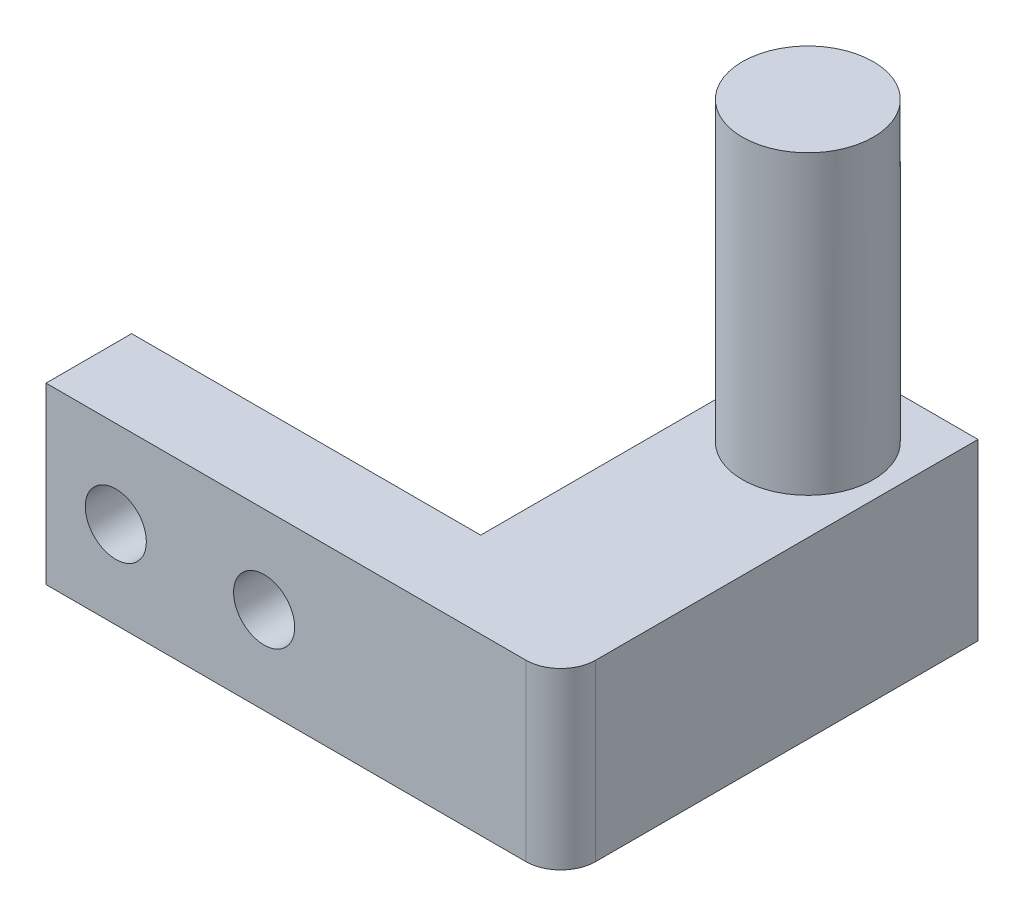
ISO-10303-21;
HEADER;
FILE_DESCRIPTION(('STEP AP214'),'2;1');
FILE_NAME('part.step','',(''),(''),'','','');
FILE_SCHEMA(('AUTOMOTIVE_DESIGN { 1 0 10303 214 1 1 1 1 }'));
ENDSEC;
DATA;
#1=APPLICATION_CONTEXT('core data for automotive mechanical design processes');
#2=APPLICATION_PROTOCOL_DEFINITION('international standard','automotive_design',2000,#1);
#3=PRODUCT_CONTEXT('',#1,'mechanical');
#4=PRODUCT('Part','Part','',(#3));
#5=PRODUCT_RELATED_PRODUCT_CATEGORY('part','',(#4));
#6=PRODUCT_DEFINITION_FORMATION('','',#4);
#7=PRODUCT_DEFINITION_CONTEXT('part definition',#1,'design');
#8=PRODUCT_DEFINITION('design','',#6,#7);
#9=PRODUCT_DEFINITION_SHAPE('','',#8);
#10=(LENGTH_UNIT() NAMED_UNIT(*) SI_UNIT(.MILLI.,.METRE.));
#11=(NAMED_UNIT(*) PLANE_ANGLE_UNIT() SI_UNIT($,.RADIAN.));
#12=(NAMED_UNIT(*) SI_UNIT($,.STERADIAN.) SOLID_ANGLE_UNIT());
#13=UNCERTAINTY_MEASURE_WITH_UNIT(LENGTH_MEASURE(1.E-05),#10,'distance_accuracy_value','');
#14=(GEOMETRIC_REPRESENTATION_CONTEXT(3) GLOBAL_UNCERTAINTY_ASSIGNED_CONTEXT((#13)) GLOBAL_UNIT_ASSIGNED_CONTEXT((#10,
#11,#12)) REPRESENTATION_CONTEXT('',''));
#15=CARTESIAN_POINT('',(0.,0.,0.));
#16=DIRECTION('',(0.,0.,1.));
#17=DIRECTION('',(1.,0.,0.));
#18=AXIS2_PLACEMENT_3D('',#15,#16,#17);
#19=CARTESIAN_POINT('',(-1.,0.,0.));
#20=DIRECTION('',(1.,0.,0.));
#21=DIRECTION('',(0.,0.,-1.));
#22=AXIS2_PLACEMENT_3D('',#19,#20,#21);
#23=PLANE('',#22);
#24=DIRECTION('',(0.,-1.,0.));
#25=VECTOR('',#24,1.);
#26=CARTESIAN_POINT('',(-0.999999999999998,0.,19.));
#27=LINE('',#26,#25);
#28=CARTESIAN_POINT('',(-0.999999999999998,10.,19.));
#29=VERTEX_POINT('',#28);
#30=CARTESIAN_POINT('',(-0.999999999999998,0.,19.));
#31=VERTEX_POINT('',#30);
#32=EDGE_CURVE('E128',#29,#31,#27,.T.);
#33=ORIENTED_EDGE('',*,*,#32,.F.);
#34=DIRECTION('',(0.,0.,-1.));
#35=VECTOR('',#34,1.);
#36=CARTESIAN_POINT('',(-1.,10.,0.));
#37=LINE('',#36,#35);
#38=CARTESIAN_POINT('',(-0.999999999999999,10.,0.));
#39=VERTEX_POINT('',#38);
#40=EDGE_CURVE('E137',#29,#39,#37,.T.);
#41=ORIENTED_EDGE('',*,*,#40,.T.);
#42=DIRECTION('',(0.,1.,0.));
#43=VECTOR('',#42,1.);
#44=CARTESIAN_POINT('',(-1.,0.,0.));
#45=LINE('',#44,#43);
#46=CARTESIAN_POINT('',(-1.,0.,0.));
#47=VERTEX_POINT('',#46);
#48=EDGE_CURVE('E140',#47,#39,#45,.T.);
#49=ORIENTED_EDGE('',*,*,#48,.F.);
#50=DIRECTION('',(0.,0.,-1.));
#51=VECTOR('',#50,1.);
#52=CARTESIAN_POINT('',(-1.,0.,0.));
#53=LINE('',#52,#51);
#54=EDGE_CURVE('E138',#31,#47,#53,.T.);
#55=ORIENTED_EDGE('',*,*,#54,.F.);
#56=EDGE_LOOP('',(#33,#41,#49,#55));
#57=FACE_BOUND('',#56,.T.);
#58=ADVANCED_FACE('F34',(#57),#23,.F.);
#59=CARTESIAN_POINT('',(8.5,0.,0.));
#60=DIRECTION('',(-1.,0.,0.));
#61=DIRECTION('',(0.,0.,1.));
#62=AXIS2_PLACEMENT_3D('',#59,#60,#61);
#63=PLANE('',#62);
#64=DIRECTION('',(0.,0.,1.));
#65=VECTOR('',#64,1.);
#66=CARTESIAN_POINT('',(8.5,10.,0.));
#67=LINE('',#66,#65);
#68=CARTESIAN_POINT('',(8.5,10.,0.));
#69=VERTEX_POINT('',#68);
#70=CARTESIAN_POINT('',(8.5,10.,21.91));
#71=VERTEX_POINT('',#70);
#72=EDGE_CURVE('E144',#69,#71,#67,.T.);
#73=ORIENTED_EDGE('',*,*,#72,.T.);
#74=DIRECTION('',(0.,1.,0.));
#75=VECTOR('',#74,1.);
#76=CARTESIAN_POINT('',(8.5,0.,21.91));
#77=LINE('',#76,#75);
#78=CARTESIAN_POINT('',(8.5,0.,21.91));
#79=VERTEX_POINT('',#78);
#80=EDGE_CURVE('E42',#71,#79,#77,.F.);
#81=ORIENTED_EDGE('',*,*,#80,.T.);
#82=DIRECTION('',(0.,0.,1.));
#83=VECTOR('',#82,1.);
#84=CARTESIAN_POINT('',(8.5,0.,0.));
#85=LINE('',#84,#83);
#86=CARTESIAN_POINT('',(8.5,0.,0.));
#87=VERTEX_POINT('',#86);
#88=EDGE_CURVE('E145',#87,#79,#85,.T.);
#89=ORIENTED_EDGE('',*,*,#88,.F.);
#90=DIRECTION('',(0.,1.,0.));
#91=VECTOR('',#90,1.);
#92=CARTESIAN_POINT('',(8.5,0.,0.));
#93=LINE('',#92,#91);
#94=EDGE_CURVE('E147',#87,#69,#93,.T.);
#95=ORIENTED_EDGE('',*,*,#94,.T.);
#96=EDGE_LOOP('',(#73,#81,#89,#95));
#97=FACE_BOUND('',#96,.T.);
#98=ADVANCED_FACE('F180',(#97),#63,.F.);
#99=CARTESIAN_POINT('',(0.,0.,10.));
#100=DIRECTION('',(0.,1.,0.));
#101=DIRECTION('',(0.,0.,1.));
#102=AXIS2_PLACEMENT_3D('',#99,#100,#101);
#103=PLANE('',#102);
#104=ORIENTED_EDGE('',*,*,#88,.T.);
#105=CARTESIAN_POINT('',(6.5,0.,21.91));
#106=DIRECTION('',(0.,1.,0.));
#107=DIRECTION('',(0.,0.,1.));
#108=AXIS2_PLACEMENT_3D('',#105,#106,#107);
#109=CIRCLE('',#108,2.);
#110=CARTESIAN_POINT('',(6.5,0.,23.91));
#111=VERTEX_POINT('',#110);
#112=EDGE_CURVE('E11',#79,#111,#109,.F.);
#113=ORIENTED_EDGE('',*,*,#112,.T.);
#114=DIRECTION('',(1.,0.,0.));
#115=VECTOR('',#114,1.);
#116=CARTESIAN_POINT('',(-21.,0.,23.91));
#117=LINE('',#116,#115);
#118=CARTESIAN_POINT('',(-21.,0.,23.91));
#119=VERTEX_POINT('',#118);
#120=EDGE_CURVE('E106',#119,#111,#117,.T.);
#121=ORIENTED_EDGE('',*,*,#120,.F.);
#122=DIRECTION('',(0.,0.,1.));
#123=VECTOR('',#122,1.);
#124=CARTESIAN_POINT('',(-21.,0.,22.91));
#125=LINE('',#124,#123);
#126=CARTESIAN_POINT('',(-21.,0.,19.));
#127=VERTEX_POINT('',#126);
#128=EDGE_CURVE('E93',#127,#119,#125,.T.);
#129=ORIENTED_EDGE('',*,*,#128,.F.);
#130=DIRECTION('',(1.,0.,0.));
#131=VECTOR('',#130,1.);
#132=CARTESIAN_POINT('',(-21.,0.,19.));
#133=LINE('',#132,#131);
#134=EDGE_CURVE('E103',#127,#31,#133,.T.);
#135=ORIENTED_EDGE('',*,*,#134,.T.);
#136=ORIENTED_EDGE('',*,*,#54,.T.);
#137=DIRECTION('',(1.,0.,0.));
#138=VECTOR('',#137,1.);
#139=CARTESIAN_POINT('',(0.,0.,0.));
#140=LINE('',#139,#138);
#141=EDGE_CURVE('E153',#47,#87,#140,.T.);
#142=ORIENTED_EDGE('',*,*,#141,.T.);
#143=EDGE_LOOP('',(#104,#113,#121,#129,#135,#136,#142));
#144=FACE_BOUND('',#143,.T.);
#145=ADVANCED_FACE('F107',(#144),#103,.F.);
#146=CARTESIAN_POINT('',(0.,10.,10.));
#147=DIRECTION('',(0.,-1.,0.));
#148=DIRECTION('',(0.,0.,-1.));
#149=AXIS2_PLACEMENT_3D('',#146,#147,#148);
#150=PLANE('',#149);
#151=CARTESIAN_POINT('',(3.75,10.,5.));
#152=DIRECTION('',(0.,-1.,0.));
#153=DIRECTION('',(0.,0.,-1.));
#154=AXIS2_PLACEMENT_3D('',#151,#152,#153);
#155=CIRCLE('',#154,3.75);
#156=CARTESIAN_POINT('',(3.75,10.,1.25));
#157=VERTEX_POINT('',#156);
#158=EDGE_CURVE('E158',#157,#157,#155,.F.);
#159=ORIENTED_EDGE('',*,*,#158,.F.);
#160=EDGE_LOOP('',(#159));
#161=FACE_BOUND('',#160,.T.);
#162=DIRECTION('',(-1.,0.,0.));
#163=VECTOR('',#162,1.);
#164=CARTESIAN_POINT('',(-21.,10.,23.91));
#165=LINE('',#164,#163);
#166=CARTESIAN_POINT('',(6.5,10.,23.91));
#167=VERTEX_POINT('',#166);
#168=CARTESIAN_POINT('',(-21.,10.,23.91));
#169=VERTEX_POINT('',#168);
#170=EDGE_CURVE('E112',#167,#169,#165,.T.);
#171=ORIENTED_EDGE('',*,*,#170,.F.);
#172=CARTESIAN_POINT('',(6.5,10.,21.91));
#173=DIRECTION('',(0.,-1.,0.));
#174=DIRECTION('',(0.,0.,-1.));
#175=AXIS2_PLACEMENT_3D('',#172,#173,#174);
#176=CIRCLE('',#175,2.);
#177=EDGE_CURVE('E56',#167,#71,#176,.F.);
#178=ORIENTED_EDGE('',*,*,#177,.T.);
#179=ORIENTED_EDGE('',*,*,#72,.F.);
#180=DIRECTION('',(-1.,0.,0.));
#181=VECTOR('',#180,1.);
#182=CARTESIAN_POINT('',(0.,10.,0.));
#183=LINE('',#182,#181);
#184=EDGE_CURVE('E155',#69,#39,#183,.T.);
#185=ORIENTED_EDGE('',*,*,#184,.T.);
#186=ORIENTED_EDGE('',*,*,#40,.F.);
#187=DIRECTION('',(1.,0.,0.));
#188=VECTOR('',#187,1.);
#189=CARTESIAN_POINT('',(-21.,10.,19.));
#190=LINE('',#189,#188);
#191=CARTESIAN_POINT('',(-21.,10.,19.));
#192=VERTEX_POINT('',#191);
#193=EDGE_CURVE('E134',#192,#29,#190,.T.);
#194=ORIENTED_EDGE('',*,*,#193,.F.);
#195=DIRECTION('',(0.,0.,-1.));
#196=VECTOR('',#195,1.);
#197=CARTESIAN_POINT('',(-21.,10.,22.91));
#198=LINE('',#197,#196);
#199=EDGE_CURVE('E126',#169,#192,#198,.T.);
#200=ORIENTED_EDGE('',*,*,#199,.F.);
#201=EDGE_LOOP('',(#171,#178,#179,#185,#186,#194,#200));
#202=FACE_BOUND('',#201,.T.);
#203=ADVANCED_FACE('F168',(#161,#202),#150,.F.);
#204=CARTESIAN_POINT('',(0.,0.,0.));
#205=DIRECTION('',(0.,0.,-1.));
#206=DIRECTION('',(-1.,0.,0.));
#207=AXIS2_PLACEMENT_3D('',#204,#205,#206);
#208=PLANE('',#207);
#209=ORIENTED_EDGE('',*,*,#48,.T.);
#210=ORIENTED_EDGE('',*,*,#184,.F.);
#211=ORIENTED_EDGE('',*,*,#94,.F.);
#212=ORIENTED_EDGE('',*,*,#141,.F.);
#213=EDGE_LOOP('',(#209,#210,#211,#212));
#214=FACE_BOUND('',#213,.T.);
#215=ADVANCED_FACE('F179',(#214),#208,.T.);
#216=CARTESIAN_POINT('',(3.75,27.,5.));
#217=DIRECTION('',(0.,-1.,0.));
#218=DIRECTION('',(0.,0.,-1.));
#219=AXIS2_PLACEMENT_3D('',#216,#217,#218);
#220=CYLINDRICAL_SURFACE('',#219,3.75);
#221=CARTESIAN_POINT('',(3.75,27.,5.));
#222=DIRECTION('',(0.,1.,0.));
#223=DIRECTION('',(0.,0.,1.));
#224=AXIS2_PLACEMENT_3D('',#221,#222,#223);
#225=CIRCLE('',#224,3.75);
#226=CARTESIAN_POINT('',(3.75,27.,8.75));
#227=VERTEX_POINT('',#226);
#228=EDGE_CURVE('E150',#227,#227,#225,.T.);
#229=ORIENTED_EDGE('',*,*,#228,.F.);
#230=EDGE_LOOP('',(#229));
#231=FACE_BOUND('',#230,.T.);
#232=ORIENTED_EDGE('',*,*,#158,.T.);
#233=EDGE_LOOP('',(#232));
#234=FACE_BOUND('',#233,.T.);
#235=ADVANCED_FACE('F199',(#231,#234),#220,.T.);
#236=CARTESIAN_POINT('',(3.75,27.,5.));
#237=DIRECTION('',(0.,1.,0.));
#238=DIRECTION('',(0.,0.,1.));
#239=AXIS2_PLACEMENT_3D('',#236,#237,#238);
#240=PLANE('',#239);
#241=ORIENTED_EDGE('',*,*,#228,.T.);
#242=EDGE_LOOP('',(#241));
#243=FACE_BOUND('',#242,.T.);
#244=ADVANCED_FACE('F196',(#243),#240,.T.);
#245=CARTESIAN_POINT('',(-21.,0.,19.));
#246=DIRECTION('',(0.,0.,1.));
#247=DIRECTION('',(1.,0.,0.));
#248=AXIS2_PLACEMENT_3D('',#245,#246,#247);
#249=PLANE('',#248);
#250=CARTESIAN_POINT('',(-8.5,5.,19.));
#251=DIRECTION('',(0.,0.,1.));
#252=DIRECTION('',(1.,0.,0.));
#253=AXIS2_PLACEMENT_3D('',#250,#251,#252);
#254=CIRCLE('',#253,1.75);
#255=CARTESIAN_POINT('',(-6.75,5.,19.));
#256=VERTEX_POINT('',#255);
#257=EDGE_CURVE('E125',#256,#256,#254,.T.);
#258=ORIENTED_EDGE('',*,*,#257,.T.);
#259=EDGE_LOOP('',(#258));
#260=FACE_BOUND('',#259,.T.);
#261=CARTESIAN_POINT('',(-17.,5.,19.));
#262=DIRECTION('',(0.,0.,1.));
#263=DIRECTION('',(1.,0.,0.));
#264=AXIS2_PLACEMENT_3D('',#261,#262,#263);
#265=CIRCLE('',#264,1.75);
#266=CARTESIAN_POINT('',(-15.25,5.,19.));
#267=VERTEX_POINT('',#266);
#268=EDGE_CURVE('E132',#267,#267,#265,.T.);
#269=ORIENTED_EDGE('',*,*,#268,.T.);
#270=EDGE_LOOP('',(#269));
#271=FACE_BOUND('',#270,.T.);
#272=ORIENTED_EDGE('',*,*,#32,.T.);
#273=ORIENTED_EDGE('',*,*,#134,.F.);
#274=DIRECTION('',(0.,-1.,0.));
#275=VECTOR('',#274,1.);
#276=CARTESIAN_POINT('',(-21.,0.,19.));
#277=LINE('',#276,#275);
#278=EDGE_CURVE('E99',#192,#127,#277,.T.);
#279=ORIENTED_EDGE('',*,*,#278,.F.);
#280=ORIENTED_EDGE('',*,*,#193,.T.);
#281=EDGE_LOOP('',(#272,#273,#279,#280));
#282=FACE_BOUND('',#281,.T.);
#283=ADVANCED_FACE('F172',(#260,#271,#282),#249,.F.);
#284=CARTESIAN_POINT('',(-21.,0.,0.));
#285=DIRECTION('',(-1.,0.,0.));
#286=DIRECTION('',(0.,0.,1.));
#287=AXIS2_PLACEMENT_3D('',#284,#285,#286);
#288=PLANE('',#287);
#289=ORIENTED_EDGE('',*,*,#128,.T.);
#290=DIRECTION('',(0.,-1.,0.));
#291=VECTOR('',#290,1.);
#292=CARTESIAN_POINT('',(-21.,0.,23.91));
#293=LINE('',#292,#291);
#294=EDGE_CURVE('E97',#169,#119,#293,.T.);
#295=ORIENTED_EDGE('',*,*,#294,.F.);
#296=ORIENTED_EDGE('',*,*,#199,.T.);
#297=ORIENTED_EDGE('',*,*,#278,.T.);
#298=EDGE_LOOP('',(#289,#295,#296,#297));
#299=FACE_BOUND('',#298,.T.);
#300=ADVANCED_FACE('F95',(#299),#288,.T.);
#301=CARTESIAN_POINT('',(-17.,5.,2.91));
#302=DIRECTION('',(0.,0.,1.));
#303=DIRECTION('',(1.,0.,0.));
#304=AXIS2_PLACEMENT_3D('',#301,#302,#303);
#305=CYLINDRICAL_SURFACE('',#304,1.75);
#306=ORIENTED_EDGE('',*,*,#268,.F.);
#307=EDGE_LOOP('',(#306));
#308=FACE_BOUND('',#307,.T.);
#309=CARTESIAN_POINT('',(-17.,5.,23.91));
#310=DIRECTION('',(0.,0.,1.));
#311=DIRECTION('',(1.,0.,0.));
#312=AXIS2_PLACEMENT_3D('',#309,#310,#311);
#313=CIRCLE('',#312,1.75);
#314=CARTESIAN_POINT('',(-15.25,5.,23.91));
#315=VERTEX_POINT('',#314);
#316=EDGE_CURVE('E117',#315,#315,#313,.T.);
#317=ORIENTED_EDGE('',*,*,#316,.T.);
#318=EDGE_LOOP('',(#317));
#319=FACE_BOUND('',#318,.T.);
#320=ADVANCED_FACE('F242',(#308,#319),#305,.F.);
#321=CARTESIAN_POINT('',(-8.5,5.,2.91));
#322=DIRECTION('',(0.,0.,1.));
#323=DIRECTION('',(1.,0.,0.));
#324=AXIS2_PLACEMENT_3D('',#321,#322,#323);
#325=CYLINDRICAL_SURFACE('',#324,1.75);
#326=ORIENTED_EDGE('',*,*,#257,.F.);
#327=EDGE_LOOP('',(#326));
#328=FACE_BOUND('',#327,.T.);
#329=CARTESIAN_POINT('',(-8.5,5.,23.91));
#330=DIRECTION('',(0.,0.,1.));
#331=DIRECTION('',(1.,0.,0.));
#332=AXIS2_PLACEMENT_3D('',#329,#330,#331);
#333=CIRCLE('',#332,1.75);
#334=CARTESIAN_POINT('',(-6.75,5.,23.91));
#335=VERTEX_POINT('',#334);
#336=EDGE_CURVE('E120',#335,#335,#333,.T.);
#337=ORIENTED_EDGE('',*,*,#336,.T.);
#338=EDGE_LOOP('',(#337));
#339=FACE_BOUND('',#338,.T.);
#340=ADVANCED_FACE('F185',(#328,#339),#325,.F.);
#341=CARTESIAN_POINT('',(0.,0.,23.91));
#342=DIRECTION('',(0.,0.,-1.));
#343=DIRECTION('',(-1.,0.,0.));
#344=AXIS2_PLACEMENT_3D('',#341,#342,#343);
#345=PLANE('',#344);
#346=ORIENTED_EDGE('',*,*,#120,.T.);
#347=DIRECTION('',(0.,1.,0.));
#348=VECTOR('',#347,1.);
#349=CARTESIAN_POINT('',(6.5,0.,23.91));
#350=LINE('',#349,#348);
#351=EDGE_CURVE('E161',#111,#167,#350,.T.);
#352=ORIENTED_EDGE('',*,*,#351,.T.);
#353=ORIENTED_EDGE('',*,*,#170,.T.);
#354=ORIENTED_EDGE('',*,*,#294,.T.);
#355=EDGE_LOOP('',(#346,#352,#353,#354));
#356=FACE_BOUND('',#355,.T.);
#357=ORIENTED_EDGE('',*,*,#316,.F.);
#358=EDGE_LOOP('',(#357));
#359=FACE_BOUND('',#358,.T.);
#360=ORIENTED_EDGE('',*,*,#336,.F.);
#361=EDGE_LOOP('',(#360));
#362=FACE_BOUND('',#361,.T.);
#363=ADVANCED_FACE('F114',(#356,#359,#362),#345,.F.);
#364=CARTESIAN_POINT('',(6.5,0.,21.91));
#365=DIRECTION('',(0.,1.,0.));
#366=DIRECTION('',(0.,0.,1.));
#367=AXIS2_PLACEMENT_3D('',#364,#365,#366);
#368=CYLINDRICAL_SURFACE('',#367,2.);
#369=ORIENTED_EDGE('',*,*,#112,.F.);
#370=ORIENTED_EDGE('',*,*,#80,.F.);
#371=ORIENTED_EDGE('',*,*,#177,.F.);
#372=ORIENTED_EDGE('',*,*,#351,.F.);
#373=EDGE_LOOP('',(#369,#370,#371,#372));
#374=FACE_BOUND('',#373,.T.);
#375=ADVANCED_FACE('F36',(#374),#368,.T.);
#376=CLOSED_SHELL('',(#58,#98,#145,#203,#215,#235,#244,#283,#300,#320,#340,#363,#375));
#377=MANIFOLD_SOLID_BREP('B2',#376);
#378=ADVANCED_BREP_SHAPE_REPRESENTATION('',(#18,#377),#14);
#379=SHAPE_DEFINITION_REPRESENTATION(#9,#378);
ENDSEC;
END-ISO-10303-21;
